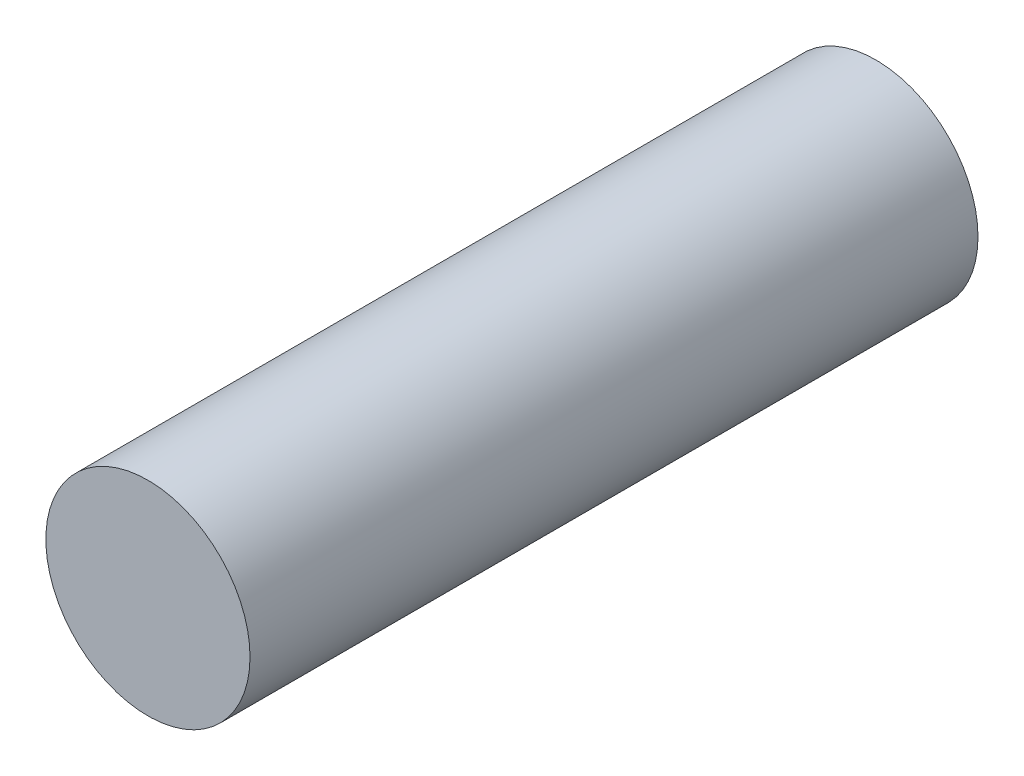
ISO-10303-21;
HEADER;
FILE_DESCRIPTION(('STEP AP214'),'2;1');
FILE_NAME('part.step','',(''),(''),'','','');
FILE_SCHEMA(('AUTOMOTIVE_DESIGN { 1 0 10303 214 1 1 1 1 }'));
ENDSEC;
DATA;
#1=APPLICATION_CONTEXT('core data for automotive mechanical design processes');
#2=APPLICATION_PROTOCOL_DEFINITION('international standard','automotive_design',2000,#1);
#3=PRODUCT_CONTEXT('',#1,'mechanical');
#4=PRODUCT('Part','Part','',(#3));
#5=PRODUCT_RELATED_PRODUCT_CATEGORY('part','',(#4));
#6=PRODUCT_DEFINITION_FORMATION('','',#4);
#7=PRODUCT_DEFINITION_CONTEXT('part definition',#1,'design');
#8=PRODUCT_DEFINITION('design','',#6,#7);
#9=PRODUCT_DEFINITION_SHAPE('','',#8);
#10=(LENGTH_UNIT() NAMED_UNIT(*) SI_UNIT(.MILLI.,.METRE.));
#11=(NAMED_UNIT(*) PLANE_ANGLE_UNIT() SI_UNIT($,.RADIAN.));
#12=(NAMED_UNIT(*) SI_UNIT($,.STERADIAN.) SOLID_ANGLE_UNIT());
#13=UNCERTAINTY_MEASURE_WITH_UNIT(LENGTH_MEASURE(1.E-05),#10,'distance_accuracy_value','');
#14=(GEOMETRIC_REPRESENTATION_CONTEXT(3) GLOBAL_UNCERTAINTY_ASSIGNED_CONTEXT((#13)) GLOBAL_UNIT_ASSIGNED_CONTEXT((#10,
#11,#12)) REPRESENTATION_CONTEXT('',''));
#15=CARTESIAN_POINT('',(0.,0.,0.));
#16=DIRECTION('',(0.,0.,1.));
#17=DIRECTION('',(1.,0.,0.));
#18=AXIS2_PLACEMENT_3D('',#15,#16,#17);
#19=CARTESIAN_POINT('',(0.,0.,65.0875));
#20=DIRECTION('',(0.,0.,-1.));
#21=DIRECTION('',(-1.,0.,0.));
#22=AXIS2_PLACEMENT_3D('',#19,#20,#21);
#23=CYLINDRICAL_SURFACE('',#22,18.25625);
#24=CARTESIAN_POINT('',(0.,0.,65.0875));
#25=DIRECTION('',(0.,0.,1.));
#26=DIRECTION('',(1.,0.,0.));
#27=AXIS2_PLACEMENT_3D('',#24,#25,#26);
#28=CIRCLE('',#27,18.25625);
#29=CARTESIAN_POINT('',(18.25625,0.,65.0875));
#30=VERTEX_POINT('',#29);
#31=EDGE_CURVE('E10',#30,#30,#28,.T.);
#32=ORIENTED_EDGE('',*,*,#31,.F.);
#33=EDGE_LOOP('',(#32));
#34=FACE_BOUND('',#33,.T.);
#35=CARTESIAN_POINT('',(0.,0.,-65.0875));
#36=DIRECTION('',(0.,0.,1.));
#37=DIRECTION('',(1.,0.,0.));
#38=AXIS2_PLACEMENT_3D('',#35,#36,#37);
#39=CIRCLE('',#38,18.25625);
#40=CARTESIAN_POINT('',(18.25625,0.,-65.0875));
#41=VERTEX_POINT('',#40);
#42=EDGE_CURVE('E38',#41,#41,#39,.T.);
#43=ORIENTED_EDGE('',*,*,#42,.T.);
#44=EDGE_LOOP('',(#43));
#45=FACE_BOUND('',#44,.T.);
#46=ADVANCED_FACE('F35',(#34,#45),#23,.T.);
#47=CARTESIAN_POINT('',(0.,0.,65.0875));
#48=DIRECTION('',(0.,0.,1.));
#49=DIRECTION('',(1.,0.,0.));
#50=AXIS2_PLACEMENT_3D('',#47,#48,#49);
#51=PLANE('',#50);
#52=ORIENTED_EDGE('',*,*,#31,.T.);
#53=EDGE_LOOP('',(#52));
#54=FACE_BOUND('',#53,.T.);
#55=ADVANCED_FACE('F50',(#54),#51,.T.);
#56=CARTESIAN_POINT('',(0.,0.,-65.0875));
#57=DIRECTION('',(0.,0.,1.));
#58=DIRECTION('',(1.,0.,0.));
#59=AXIS2_PLACEMENT_3D('',#56,#57,#58);
#60=PLANE('',#59);
#61=ORIENTED_EDGE('',*,*,#42,.F.);
#62=EDGE_LOOP('',(#61));
#63=FACE_BOUND('',#62,.T.);
#64=ADVANCED_FACE('F48',(#63),#60,.F.);
#65=CLOSED_SHELL('',(#46,#55,#64));
#66=MANIFOLD_SOLID_BREP('B2',#65);
#67=ADVANCED_BREP_SHAPE_REPRESENTATION('',(#18,#66),#14);
#68=SHAPE_DEFINITION_REPRESENTATION(#9,#67);
ENDSEC;
END-ISO-10303-21;
